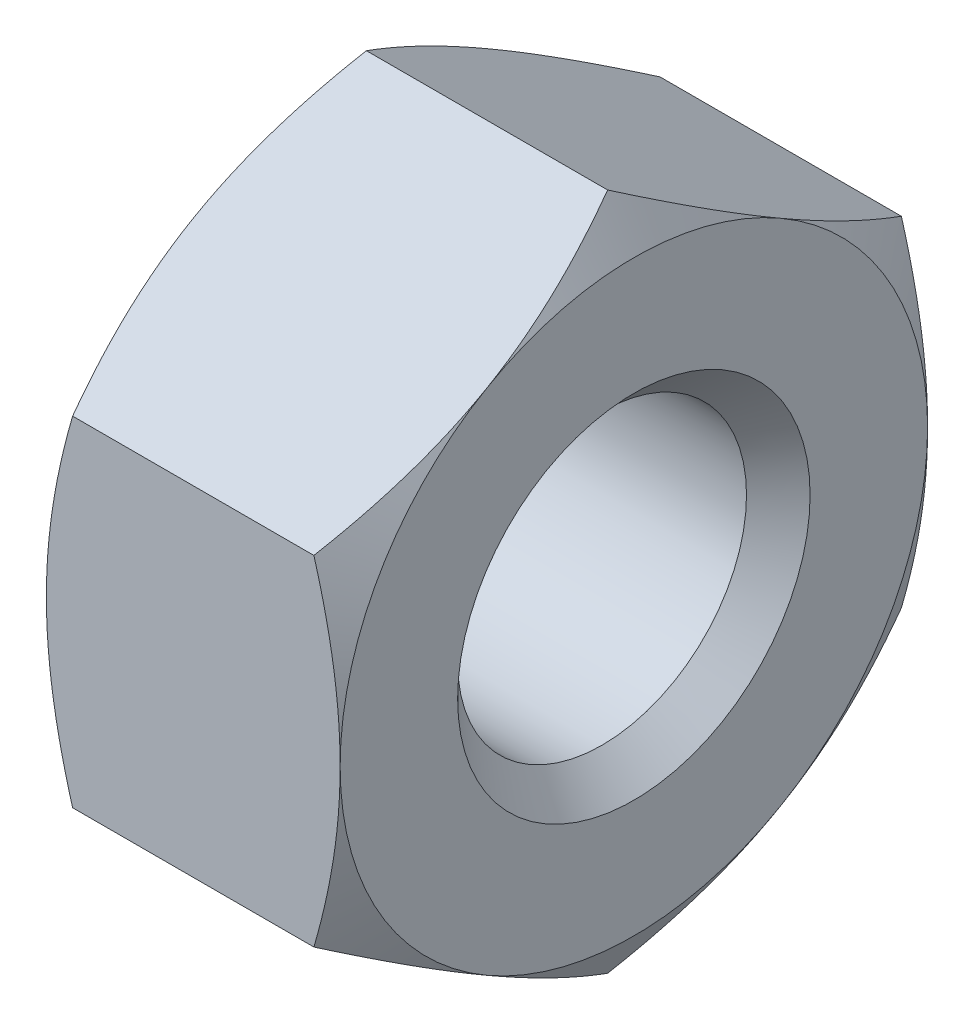
ISO-10303-21;
HEADER;
FILE_DESCRIPTION(('STEP AP214'),'2;1');
FILE_NAME('part.step','',(''),(''),'','','');
FILE_SCHEMA(('AUTOMOTIVE_DESIGN { 1 0 10303 214 1 1 1 1 }'));
ENDSEC;
DATA;
#1=APPLICATION_CONTEXT('core data for automotive mechanical design processes');
#2=APPLICATION_PROTOCOL_DEFINITION('international standard','automotive_design',2000,#1);
#3=PRODUCT_CONTEXT('',#1,'mechanical');
#4=PRODUCT('Part','Part','',(#3));
#5=PRODUCT_RELATED_PRODUCT_CATEGORY('part','',(#4));
#6=PRODUCT_DEFINITION_FORMATION('','',#4);
#7=PRODUCT_DEFINITION_CONTEXT('part definition',#1,'design');
#8=PRODUCT_DEFINITION('design','',#6,#7);
#9=PRODUCT_DEFINITION_SHAPE('','',#8);
#10=(LENGTH_UNIT() NAMED_UNIT(*) SI_UNIT(.MILLI.,.METRE.));
#11=(NAMED_UNIT(*) PLANE_ANGLE_UNIT() SI_UNIT($,.RADIAN.));
#12=(NAMED_UNIT(*) SI_UNIT($,.STERADIAN.) SOLID_ANGLE_UNIT());
#13=UNCERTAINTY_MEASURE_WITH_UNIT(LENGTH_MEASURE(1.E-05),#10,'distance_accuracy_value','');
#14=(GEOMETRIC_REPRESENTATION_CONTEXT(3) GLOBAL_UNCERTAINTY_ASSIGNED_CONTEXT((#13)) GLOBAL_UNIT_ASSIGNED_CONTEXT((#10,
#11,#12)) REPRESENTATION_CONTEXT('',''));
#15=CARTESIAN_POINT('',(0.,0.,0.));
#16=DIRECTION('',(0.,0.,1.));
#17=DIRECTION('',(1.,0.,0.));
#18=AXIS2_PLACEMENT_3D('',#15,#16,#17);
#19=CARTESIAN_POINT('',(0.,0.,0.));
#20=DIRECTION('',(1.,0.,0.));
#21=DIRECTION('',(0.,0.,1.));
#22=AXIS2_PLACEMENT_3D('',#19,#20,#21);
#23=CONICAL_SURFACE('',#22,5.,1.0471975511966);
#24=CARTESIAN_POINT('',(0.44658265405207,5.7735038465968,1.99999999777956E-06));
#25=CARTESIAN_POINT('',(0.37332598716151,5.64664194849674,-0.219729253053926));
#26=CARTESIAN_POINT('',(0.306696499123913,5.51869499330503,-0.441339880119704));
#27=CARTESIAN_POINT('',(0.190396118236588,5.26058573190113,-0.888398234775336));
#28=CARTESIAN_POINT('',(0.140766361965004,5.1304188409881,-1.11385390329997));
#29=CARTESIAN_POINT('',(0.0635265661027221,4.87167833614423,-1.56200560366558));
#30=CARTESIAN_POINT('',(0.0354020000705384,4.74314500903636,-1.78463185668229));
#31=CARTESIAN_POINT('',(0.010185357115864,4.54989306416545,-2.1193540438602));
#32=CARTESIAN_POINT('',(0.00460678031103294,4.48543168714627,-2.23100442398328));
#33=CARTESIAN_POINT('',(-0.000798864516523034,4.35644942308917,-2.45440825860544));
#34=CARTESIAN_POINT('',(-0.000626110285725697,4.29192853795199,-2.56616170981234));
#35=CARTESIAN_POINT('',(0.00776164598232361,4.11517425168036,-2.87230911409038));
#36=CARTESIAN_POINT('',(0.0218388857035264,4.00299946429515,-3.0666015451698));
#37=CARTESIAN_POINT('',(0.0664713963261781,3.77939435471464,-3.45389695579526));
#38=CARTESIAN_POINT('',(0.0970419133402497,3.66796481805389,-3.64689857475554));
#39=CARTESIAN_POINT('',(0.173457793217001,3.44390947117283,-4.034973819261));
#40=CARTESIAN_POINT('',(0.219626846873475,3.33131192785643,-4.22999848509243));
#41=CARTESIAN_POINT('',(0.324411243516021,3.10779574582578,-4.61713986868334));
#42=CARTESIAN_POINT('',(0.383001981758949,2.99687424581388,-4.8092615423557));
#43=CARTESIAN_POINT('',(0.446582654052072,2.88675019124759,-5.000002));
#44=B_SPLINE_CURVE_WITH_KNOTS('',3,(#24,#25,#26,#27,#28,#29,#30,#31,#32,#33,#34,#35,#36,#37,#38,
#39,#40,#41,#42,#43),.UNSPECIFIED.,.F.,.F.,(4,2,2,2,2,2,2,2,2,4),(0.,0.792540187012441,
1.5869848631385,2.36176947896395,2.7487878698634,3.13579429986344,3.80946255620209,
4.48375460996337,5.17299926182492,5.86089121185927),.UNSPECIFIED.);
#45=CARTESIAN_POINT('',(0.,4.3301270189222,-2.5));
#46=VERTEX_POINT('',#45);
#47=CARTESIAN_POINT('',(0.446581987385204,2.88675134594813,-5.));
#48=VERTEX_POINT('',#47);
#49=EDGE_CURVE('E222',#46,#48,#44,.T.);
#50=ORIENTED_EDGE('',*,*,#49,.T.);
#51=CARTESIAN_POINT('',(2.39269148779686,7.65620989160719,-5.));
#52=CARTESIAN_POINT('',(2.28660235028858,7.43668068445187,-5.));
#53=CARTESIAN_POINT('',(2.18156779028806,7.21663244981121,-5.));
#54=CARTESIAN_POINT('',(1.97421044339545,6.775217292149,-5.));
#55=CARTESIAN_POINT('',(1.87188812598847,6.55385014884432,-5.));
#56=CARTESIAN_POINT('',(1.67001886896127,6.10832079221155,-5.));
#57=CARTESIAN_POINT('',(1.57049116143975,5.8841498332562,-5.));
#58=CARTESIAN_POINT('',(1.37571053321072,5.43396545890422,-5.));
#59=CARTESIAN_POINT('',(1.28045738968839,5.20795214026934,-5.));
#60=CARTESIAN_POINT('',(1.09423146437322,4.75091730358843,-5.));
#61=CARTESIAN_POINT('',(1.00332560531799,4.51986836696229,-5.));
#62=CARTESIAN_POINT('',(0.82863336464981,4.05504511794165,-5.));
#63=CARTESIAN_POINT('',(0.744847775114849,3.82127050561654,-5.));
#64=CARTESIAN_POINT('',(0.586647048773664,3.3511049214154,-5.));
#65=CARTESIAN_POINT('',(0.512211991475932,3.1147207202618,-5.));
#66=CARTESIAN_POINT('',(0.375130527892477,2.63858935414023,-5.));
#67=CARTESIAN_POINT('',(0.312480393737602,2.39884327849117,-5.));
#68=CARTESIAN_POINT('',(0.20200698482826,1.91583600979795,-5.));
#69=CARTESIAN_POINT('',(0.154187651535998,1.67257390027251,-5.));
#70=CARTESIAN_POINT('',(0.076607391051974,1.18308256945893,-5.));
#71=CARTESIAN_POINT('',(0.0468464796939312,0.936853345569398,-5.));
#72=CARTESIAN_POINT('',(0.0176567486688216,0.567117593289448,-5.));
#73=CARTESIAN_POINT('',(0.0105006336509126,0.444189898759252,-5.));
#74=CARTESIAN_POINT('',(0.00139734410694163,0.198136128994918,-5.));
#75=CARTESIAN_POINT('',(-0.000549898076788793,0.0750100563582855,-5.));
#76=CARTESIAN_POINT('',(0.000816862251923973,-0.171177216207569,-5.));
#77=CARTESIAN_POINT('',(0.00412938670343826,-0.294238424644023,-5.));
#78=CARTESIAN_POINT('',(0.0159317259689098,-0.540114422491313,-5.));
#79=CARTESIAN_POINT('',(0.0244218020511685,-0.662929199152971,-5.));
#80=CARTESIAN_POINT('',(0.0510977870839178,-0.960602635172518,-5.));
#81=CARTESIAN_POINT('',(0.0718785337524636,-1.13523252606317,-5.));
#82=CARTESIAN_POINT('',(0.122751407752216,-1.48312982453558,-5.));
#83=CARTESIAN_POINT('',(0.152844776631892,-1.65639704728773,-5.));
#84=CARTESIAN_POINT('',(0.221278562314374,-2.0014599099285,-5.));
#85=CARTESIAN_POINT('',(0.259627212482436,-2.17325390132186,-5.));
#86=CARTESIAN_POINT('',(0.343401963406937,-2.51508012917844,-5.));
#87=CARTESIAN_POINT('',(0.388827633284757,-2.68511247222647,-5.));
#88=CARTESIAN_POINT('',(0.48685534457665,-3.02759472997325,-5.));
#89=CARTESIAN_POINT('',(0.539605921564314,-3.20000183568427,-5.));
#90=CARTESIAN_POINT('',(0.650319392974467,-3.54299370259062,-5.));
#91=CARTESIAN_POINT('',(0.708278692348679,-3.71357963115188,-5.));
#92=CARTESIAN_POINT('',(0.828212380999504,-4.0522446464634,-5.));
#93=CARTESIAN_POINT('',(0.890162334838547,-4.22033243885281,-5.));
#94=CARTESIAN_POINT('',(1.01769851692208,-4.55520387372807,-5.));
#95=CARTESIAN_POINT('',(1.08328621472348,-4.72198695763952,-5.));
#96=CARTESIAN_POINT('',(1.15033293692307,-4.88816412582648,-5.));
#97=B_SPLINE_CURVE_WITH_KNOTS('',3,(#51,#52,#53,#54,#55,#56,#57,#58,#59,#60,#61,#62,#63,#64,#65,
#66,#67,#68,#69,#70,#71,#72,#73,#74,#75,#76,#77,#78,#79,#80,#81,#82,#83,#84,#85,#86,#87,#88,#89,
#90,#91,#92,#93,#94,#95,#96),.UNSPECIFIED.,.F.,.F.,(4,2,2,2,2,2,2,2,2,2,2,2,2,2,2,2,2,2,2,2,2,2,
4),(0.,0.731468501053905,1.46306280212576,2.19884351250473,2.93458582511369,3.67936259473396,
4.42422210717282,5.16746683356836,5.91047605604179,6.65368257320434,7.39688974201328,
7.76620341787991,8.13551229673491,8.50471741349089,8.87394116252394,9.40123334160666,
9.92859584900566,10.456486776027,10.9843455753877,11.5251349139371,12.0655538262241,
12.6029309498223,13.1405267642076),.UNSPECIFIED.);
#98=CARTESIAN_POINT('',(0.,0.,-5.));
#99=VERTEX_POINT('',#98);
#100=EDGE_CURVE('E118',#48,#99,#97,.T.);
#101=ORIENTED_EDGE('',*,*,#100,.T.);
#102=CARTESIAN_POINT('',(0.,0.,0.));
#103=DIRECTION('',(-1.,0.,0.));
#104=DIRECTION('',(0.,0.,-1.));
#105=AXIS2_PLACEMENT_3D('',#102,#103,#104);
#106=CIRCLE('',#105,5.);
#107=EDGE_CURVE('E256',#46,#99,#106,.T.);
#108=ORIENTED_EDGE('',*,*,#107,.F.);
#109=EDGE_LOOP('',(#50,#101,#108));
#110=FACE_BOUND('',#109,.T.);
#111=ADVANCED_FACE('F15',(#110),#23,.T.);
#112=CARTESIAN_POINT('',(0.,-4.3301270189222,-2.5));
#113=VERTEX_POINT('',#112);
#114=EDGE_CURVE('E248',#99,#113,#106,.T.);
#115=ORIENTED_EDGE('',*,*,#114,.F.);
#116=CARTESIAN_POINT('',(0.446581987385204,-2.88675134594813,-5.));
#117=VERTEX_POINT('',#116);
#118=EDGE_CURVE('E216',#99,#117,#97,.T.);
#119=ORIENTED_EDGE('',*,*,#118,.T.);
#120=CARTESIAN_POINT('',(0.446582654052072,-2.88675019124759,-5.000002));
#121=CARTESIAN_POINT('',(0.373325987161512,-3.01361208934765,-4.78027074694607));
#122=CARTESIAN_POINT('',(0.306696499123915,-3.14155904453936,-4.5586601198803));
#123=CARTESIAN_POINT('',(0.19039611823659,-3.39966830594326,-4.11160176522466));
#124=CARTESIAN_POINT('',(0.140766361965006,-3.52983519685628,-3.88614609670003));
#125=CARTESIAN_POINT('',(0.0635265661027237,-3.78857570170016,-3.43799439633442));
#126=CARTESIAN_POINT('',(0.0354020000705395,-3.91710902880803,-3.21536814331771));
#127=CARTESIAN_POINT('',(0.0101853571158656,-4.11036097367894,-2.8806459561398));
#128=CARTESIAN_POINT('',(0.00460678031103495,-4.17482235069812,-2.76899557601673));
#129=CARTESIAN_POINT('',(-0.000798864516521227,-4.30380461475522,-2.54559174139456));
#130=CARTESIAN_POINT('',(-0.000626110285724489,-4.3683254998924,-2.43383829018766));
#131=CARTESIAN_POINT('',(0.00776164598232428,-4.54507978616402,-2.12769088590962));
#132=CARTESIAN_POINT('',(0.021838885703528,-4.65725457354923,-1.9333984548302));
#133=CARTESIAN_POINT('',(0.06647139632618,-4.88085968312975,-1.54610304420474));
#134=CARTESIAN_POINT('',(0.0970419133402511,-4.9922892197905,-1.35310142524446));
#135=CARTESIAN_POINT('',(0.173457793217002,-5.21634456667156,-0.965026180739005));
#136=CARTESIAN_POINT('',(0.219626846873477,-5.32894210998796,-0.770001514907569));
#137=CARTESIAN_POINT('',(0.324411243516023,-5.55245829201861,-0.382860131316659));
#138=CARTESIAN_POINT('',(0.383001981758951,-5.66337979203051,-0.1907384576443));
#139=CARTESIAN_POINT('',(0.446582654052072,-5.7735038465968,2.00000000049962E-06));
#140=B_SPLINE_CURVE_WITH_KNOTS('',3,(#120,#121,#122,#123,#124,#125,#126,#127,#128,#129,#130,
#131,#132,#133,#134,#135,#136,#137,#138,#139),.UNSPECIFIED.,.F.,.F.,(4,2,2,2,2,2,2,2,2,4),(0.,
0.79254018701244,1.58698486313849,2.36176947896395,2.74878786986339,3.13579429986343,
3.80946255620209,4.48375460996337,5.17299926182492,5.86089121185927),.UNSPECIFIED.);
#141=EDGE_CURVE('E210',#117,#113,#140,.T.);
#142=ORIENTED_EDGE('',*,*,#141,.T.);
#143=EDGE_LOOP('',(#115,#119,#142));
#144=FACE_BOUND('',#143,.T.);
#145=ADVANCED_FACE('F245',(#144),#23,.T.);
#146=CARTESIAN_POINT('',(0.,-4.33012701892219,2.5));
#147=VERTEX_POINT('',#146);
#148=EDGE_CURVE('E254',#113,#147,#106,.T.);
#149=ORIENTED_EDGE('',*,*,#148,.F.);
#150=CARTESIAN_POINT('',(0.446581987385205,-5.77350269189626,0.));
#151=VERTEX_POINT('',#150);
#152=EDGE_CURVE('E202',#113,#151,#140,.T.);
#153=ORIENTED_EDGE('',*,*,#152,.T.);
#154=CARTESIAN_POINT('',(0.446582654052072,-5.7735038465968,-1.99999999964649E-06));
#155=CARTESIAN_POINT('',(0.373325987161511,-5.64664194849674,0.219729253053924));
#156=CARTESIAN_POINT('',(0.306696499123914,-5.51869499330503,0.441339880119701));
#157=CARTESIAN_POINT('',(0.190396118236588,-5.26058573190113,0.888398234775332));
#158=CARTESIAN_POINT('',(0.140766361965004,-5.1304188409881,1.11385390329997));
#159=CARTESIAN_POINT('',(0.0635265661027221,-4.87167833614423,1.56200560366558));
#160=CARTESIAN_POINT('',(0.0354020000705381,-4.74314500903636,1.78463185668228));
#161=CARTESIAN_POINT('',(0.0101853571158635,-4.54989306416545,2.1193540438602));
#162=CARTESIAN_POINT('',(0.00460678031103241,-4.48543168714627,2.23100442398327));
#163=CARTESIAN_POINT('',(-0.000798864516523425,-4.35644942308917,2.45440825860543));
#164=CARTESIAN_POINT('',(-0.000626110285725903,-4.29192853795199,2.56616170981234));
#165=CARTESIAN_POINT('',(0.00776164598232342,-4.11517425168036,2.87230911409038));
#166=CARTESIAN_POINT('',(0.0218388857035257,-4.00299946429515,3.06660154516979));
#167=CARTESIAN_POINT('',(0.0664713963261767,-3.77939435471464,3.45389695579525));
#168=CARTESIAN_POINT('',(0.097041913340248,-3.66796481805388,3.64689857475554));
#169=CARTESIAN_POINT('',(0.173457793216999,-3.44390947117283,4.03497381926099));
#170=CARTESIAN_POINT('',(0.219626846873474,-3.33131192785643,4.22999848509243));
#171=CARTESIAN_POINT('',(0.32441124351602,-3.10779574582577,4.61713986868334));
#172=CARTESIAN_POINT('',(0.383001981758949,-2.99687424581388,4.8092615423557));
#173=CARTESIAN_POINT('',(0.446582654052072,-2.88675019124759,5.000002));
#174=B_SPLINE_CURVE_WITH_KNOTS('',3,(#154,#155,#156,#157,#158,#159,#160,#161,#162,#163,#164,
#165,#166,#167,#168,#169,#170,#171,#172,#173),.UNSPECIFIED.,.F.,.F.,(4,2,2,2,2,2,2,2,2,4),(0.,
0.79254018701244,1.5869848631385,2.36176947896395,2.7487878698634,3.13579429986344,
3.80946255620209,4.48375460996337,5.17299926182492,5.86089121185928),.UNSPECIFIED.);
#175=EDGE_CURVE('E505',#151,#147,#174,.T.);
#176=ORIENTED_EDGE('',*,*,#175,.T.);
#177=EDGE_LOOP('',(#149,#153,#176));
#178=FACE_BOUND('',#177,.T.);
#179=ADVANCED_FACE('F336',(#178),#23,.T.);
#180=CARTESIAN_POINT('',(0.446582654052071,2.88675019124759,5.000002));
#181=CARTESIAN_POINT('',(0.373325987161511,3.01361208934765,4.78027074694607));
#182=CARTESIAN_POINT('',(0.306696499123914,3.14155904453936,4.55866011988029));
#183=CARTESIAN_POINT('',(0.190396118236589,3.39966830594326,4.11160176522466));
#184=CARTESIAN_POINT('',(0.140766361965004,3.52983519685628,3.88614609670003));
#185=CARTESIAN_POINT('',(0.063526566102723,3.78857570170016,3.43799439633442));
#186=CARTESIAN_POINT('',(0.0354020000705395,3.91710902880803,3.21536814331771));
#187=CARTESIAN_POINT('',(0.0101853571158649,4.11036097367894,2.8806459561398));
#188=CARTESIAN_POINT('',(0.00460678031103366,4.17482235069812,2.76899557601673));
#189=CARTESIAN_POINT('',(-0.000798864516522484,4.30380461475522,2.54559174139456));
#190=CARTESIAN_POINT('',(-0.000626110285725161,4.3683254998924,2.43383829018766));
#191=CARTESIAN_POINT('',(0.0077616459823242,4.54507978616402,2.12769088590962));
#192=CARTESIAN_POINT('',(0.0218388857035272,4.65725457354923,1.9333984548302));
#193=CARTESIAN_POINT('',(0.0664713963261789,4.88085968312975,1.54610304420474));
#194=CARTESIAN_POINT('',(0.0970419133402503,4.9922892197905,1.35310142524446));
#195=CARTESIAN_POINT('',(0.173457793217002,5.21634456667156,0.965026180739003));
#196=CARTESIAN_POINT('',(0.219626846873476,5.32894210998796,0.770001514907566));
#197=CARTESIAN_POINT('',(0.324411243516022,5.55245829201861,0.382860131316657));
#198=CARTESIAN_POINT('',(0.383001981758949,5.66337979203051,0.190738457644298));
#199=CARTESIAN_POINT('',(0.446582654052071,5.7735038465968,-2.00000000201083E-06));
#200=B_SPLINE_CURVE_WITH_KNOTS('',3,(#180,#181,#182,#183,#184,#185,#186,#187,#188,#189,#190,
#191,#192,#193,#194,#195,#196,#197,#198,#199),.UNSPECIFIED.,.F.,.F.,(4,2,2,2,2,2,2,2,2,4),(0.,
0.79254018701244,1.5869848631385,2.36176947896395,2.7487878698634,3.13579429986343,
3.80946255620209,4.48375460996337,5.17299926182492,5.86089121185927),.UNSPECIFIED.);
#201=CARTESIAN_POINT('',(0.,4.3301270189222,2.5));
#202=VERTEX_POINT('',#201);
#203=CARTESIAN_POINT('',(0.446581987385204,5.77350269189626,0.));
#204=VERTEX_POINT('',#203);
#205=EDGE_CURVE('E362',#202,#204,#200,.T.);
#206=ORIENTED_EDGE('',*,*,#205,.T.);
#207=EDGE_CURVE('E211',#204,#46,#44,.T.);
#208=ORIENTED_EDGE('',*,*,#207,.T.);
#209=EDGE_CURVE('E265',#202,#46,#106,.T.);
#210=ORIENTED_EDGE('',*,*,#209,.F.);
#211=EDGE_LOOP('',(#206,#208,#210));
#212=FACE_BOUND('',#211,.T.);
#213=ADVANCED_FACE('F344',(#212),#23,.T.);
#214=CARTESIAN_POINT('',(0.,0.,5.));
#215=VERTEX_POINT('',#214);
#216=EDGE_CURVE('E262',#147,#215,#106,.T.);
#217=ORIENTED_EDGE('',*,*,#216,.F.);
#218=CARTESIAN_POINT('',(0.446581987385204,-2.88675134594812,5.));
#219=VERTEX_POINT('',#218);
#220=EDGE_CURVE('E37',#147,#219,#174,.T.);
#221=ORIENTED_EDGE('',*,*,#220,.T.);
#222=CARTESIAN_POINT('',(2.39269148779686,7.6562098916072,5.));
#223=CARTESIAN_POINT('',(2.28660235028858,7.43668068445188,5.));
#224=CARTESIAN_POINT('',(2.18156779028806,7.21663244981121,5.));
#225=CARTESIAN_POINT('',(1.97421044339545,6.77521729214901,5.));
#226=CARTESIAN_POINT('',(1.87188812598847,6.55385014884433,5.));
#227=CARTESIAN_POINT('',(1.67001886896127,6.10832079221155,5.));
#228=CARTESIAN_POINT('',(1.57049116143975,5.8841498332562,5.));
#229=CARTESIAN_POINT('',(1.37571053321072,5.43396545890423,5.));
#230=CARTESIAN_POINT('',(1.28045738968839,5.20795214026935,5.));
#231=CARTESIAN_POINT('',(1.09423146437322,4.75091730358843,5.));
#232=CARTESIAN_POINT('',(1.00332560531799,4.51986836696229,5.));
#233=CARTESIAN_POINT('',(0.82863336464981,4.05504511794166,5.));
#234=CARTESIAN_POINT('',(0.744847775114849,3.82127050561655,5.));
#235=CARTESIAN_POINT('',(0.586647048773665,3.3511049214154,5.));
#236=CARTESIAN_POINT('',(0.512211991475933,3.1147207202618,5.));
#237=CARTESIAN_POINT('',(0.375130527892477,2.63858935414024,5.));
#238=CARTESIAN_POINT('',(0.312480393737602,2.39884327849118,5.));
#239=CARTESIAN_POINT('',(0.202006984828261,1.91583600979795,5.));
#240=CARTESIAN_POINT('',(0.154187651535998,1.67257390027251,5.));
#241=CARTESIAN_POINT('',(0.0766073910519745,1.18308256945893,5.));
#242=CARTESIAN_POINT('',(0.0468464796939318,0.936853345569402,5.));
#243=CARTESIAN_POINT('',(0.0176567486688219,0.567117593289453,5.));
#244=CARTESIAN_POINT('',(0.0105006336509127,0.444189898759257,5.));
#245=CARTESIAN_POINT('',(0.00139734410694169,0.198136128994924,5.));
#246=CARTESIAN_POINT('',(-0.000549898076788581,0.0750100563582913,5.));
#247=CARTESIAN_POINT('',(0.000816862251924464,-0.171177216207563,5.));
#248=CARTESIAN_POINT('',(0.00412938670343887,-0.294238424644018,5.));
#249=CARTESIAN_POINT('',(0.0159317259689104,-0.540114422491308,5.));
#250=CARTESIAN_POINT('',(0.024421802051169,-0.662929199152966,5.));
#251=CARTESIAN_POINT('',(0.0510977870839183,-0.960602635172514,5.));
#252=CARTESIAN_POINT('',(0.0718785337524642,-1.13523252606317,5.));
#253=CARTESIAN_POINT('',(0.122751407752217,-1.48312982453558,5.));
#254=CARTESIAN_POINT('',(0.152844776631893,-1.65639704728773,5.));
#255=CARTESIAN_POINT('',(0.221278562314375,-2.00145990992849,5.));
#256=CARTESIAN_POINT('',(0.259627212482438,-2.17325390132185,5.));
#257=CARTESIAN_POINT('',(0.343401963406939,-2.51508012917843,5.));
#258=CARTESIAN_POINT('',(0.388827633284758,-2.68511247222647,5.));
#259=CARTESIAN_POINT('',(0.486855344576652,-3.02759472997325,5.));
#260=CARTESIAN_POINT('',(0.539605921564316,-3.20000183568427,5.));
#261=CARTESIAN_POINT('',(0.650319392974469,-3.54299370259062,5.));
#262=CARTESIAN_POINT('',(0.708278692348681,-3.71357963115188,5.));
#263=CARTESIAN_POINT('',(0.828212380999506,-4.0522446464634,5.));
#264=CARTESIAN_POINT('',(0.890162334838549,-4.22033243885281,5.00000000000001));
#265=CARTESIAN_POINT('',(1.01769851692208,-4.55520387372807,5.00000000000001));
#266=CARTESIAN_POINT('',(1.08328621472348,-4.72198695763951,5.));
#267=CARTESIAN_POINT('',(1.15033293692307,-4.88816412582648,5.));
#268=B_SPLINE_CURVE_WITH_KNOTS('',3,(#222,#223,#224,#225,#226,#227,#228,#229,#230,#231,#232,
#233,#234,#235,#236,#237,#238,#239,#240,#241,#242,#243,#244,#245,#246,#247,#248,#249,#250,#251,
#252,#253,#254,#255,#256,#257,#258,#259,#260,#261,#262,#263,#264,#265,#266,#267),.UNSPECIFIED.,
.F.,.F.,(4,2,2,2,2,2,2,2,2,2,2,2,2,2,2,2,2,2,2,2,2,2,4),(0.,0.731468501053905,1.46306280212576,
2.19884351250474,2.93458582511369,3.67936259473396,4.42422210717282,5.16746683356836,
5.91047605604179,6.65368257320434,7.39688974201329,7.76620341787991,8.13551229673491,
8.5047174134909,8.87394116252395,9.40123334160666,9.92859584900567,10.456486776027,
10.9843455753877,11.5251349139371,12.0655538262241,12.6029309498223,13.1405267642076),.UNSPECIFIED.);
#269=EDGE_CURVE('E9',#219,#215,#268,.F.);
#270=ORIENTED_EDGE('',*,*,#269,.T.);
#271=EDGE_LOOP('',(#217,#221,#270));
#272=FACE_BOUND('',#271,.T.);
#273=ADVANCED_FACE('F339',(#272),#23,.T.);
#274=CARTESIAN_POINT('',(0.446581987385204,2.88675134594813,5.));
#275=VERTEX_POINT('',#274);
#276=EDGE_CURVE('E20',#215,#275,#268,.F.);
#277=ORIENTED_EDGE('',*,*,#276,.T.);
#278=EDGE_CURVE('E125',#275,#202,#200,.T.);
#279=ORIENTED_EDGE('',*,*,#278,.T.);
#280=EDGE_CURVE('E272',#215,#202,#106,.T.);
#281=ORIENTED_EDGE('',*,*,#280,.F.);
#282=EDGE_LOOP('',(#277,#279,#281));
#283=FACE_BOUND('',#282,.T.);
#284=ADVANCED_FACE('F152',(#283),#23,.T.);
#285=CARTESIAN_POINT('',(4.55255354137804,0.,0.));
#286=DIRECTION('',(-1.,0.,0.));
#287=DIRECTION('',(0.,0.,-1.));
#288=AXIS2_PLACEMENT_3D('',#285,#286,#287);
#289=CONICAL_SURFACE('',#288,5.775,1.0471975511966);
#290=CARTESIAN_POINT('',(2.60730851220314,7.6562098916072,5.));
#291=CARTESIAN_POINT('',(2.71339764971142,7.43668068445188,5.));
#292=CARTESIAN_POINT('',(2.81843220971194,7.21663244981121,5.));
#293=CARTESIAN_POINT('',(3.02578955660455,6.77521729214901,5.));
#294=CARTESIAN_POINT('',(3.12811187401152,6.55385014884433,5.));
#295=CARTESIAN_POINT('',(3.32998113103873,6.10832079221155,5.));
#296=CARTESIAN_POINT('',(3.42950883856025,5.8841498332562,5.));
#297=CARTESIAN_POINT('',(3.62428946678928,5.43396545890423,5.));
#298=CARTESIAN_POINT('',(3.71954261031161,5.20795214026935,5.));
#299=CARTESIAN_POINT('',(3.90576853562678,4.75091730358843,5.));
#300=CARTESIAN_POINT('',(3.99667439468201,4.51986836696229,5.));
#301=CARTESIAN_POINT('',(4.17136663535019,4.05504511794166,5.));
#302=CARTESIAN_POINT('',(4.25515222488515,3.82127050561655,5.));
#303=CARTESIAN_POINT('',(4.41335295122633,3.35110492141541,5.));
#304=CARTESIAN_POINT('',(4.48778800852407,3.1147207202618,5.));
#305=CARTESIAN_POINT('',(4.62486947210752,2.63858935414024,5.));
#306=CARTESIAN_POINT('',(4.6875196062624,2.39884327849118,5.));
#307=CARTESIAN_POINT('',(4.79799301517174,1.91583600979796,5.));
#308=CARTESIAN_POINT('',(4.845812348464,1.67257390027252,5.));
#309=CARTESIAN_POINT('',(4.92339260894802,1.18308256945893,5.));
#310=CARTESIAN_POINT('',(4.95315352030607,0.936853345569404,5.));
#311=CARTESIAN_POINT('',(4.98234325133118,0.567117593289454,5.));
#312=CARTESIAN_POINT('',(4.98949936634909,0.444189898759258,5.));
#313=CARTESIAN_POINT('',(4.99860265589306,0.198136128994925,5.));
#314=CARTESIAN_POINT('',(5.00054989807679,0.0750100563582916,5.));
#315=CARTESIAN_POINT('',(4.99918313774807,-0.171177216207563,5.));
#316=CARTESIAN_POINT('',(4.99587061329656,-0.294238424644017,5.));
#317=CARTESIAN_POINT('',(4.98406827403109,-0.540114422491307,5.));
#318=CARTESIAN_POINT('',(4.97557819794883,-0.662929199152966,5.));
#319=CARTESIAN_POINT('',(4.94890221291608,-0.960602635172514,5.));
#320=CARTESIAN_POINT('',(4.92812146624754,-1.13523252606317,5.));
#321=CARTESIAN_POINT('',(4.87724859224778,-1.48312982453558,5.));
#322=CARTESIAN_POINT('',(4.84715522336811,-1.65639704728773,5.));
#323=CARTESIAN_POINT('',(4.77872143768563,-2.0014599099285,5.));
#324=CARTESIAN_POINT('',(4.74037278751756,-2.17325390132186,5.));
#325=CARTESIAN_POINT('',(4.65659803659306,-2.51508012917844,5.));
#326=CARTESIAN_POINT('',(4.61117236671524,-2.68511247222647,5.));
#327=CARTESIAN_POINT('',(4.51314465542335,-3.02759472997325,5.));
#328=CARTESIAN_POINT('',(4.46039407843569,-3.20000183568427,5.));
#329=CARTESIAN_POINT('',(4.34968060702553,-3.54299370259062,5.));
#330=CARTESIAN_POINT('',(4.29172130765132,-3.71357963115188,5.));
#331=CARTESIAN_POINT('',(4.17178761900049,-4.05224464646339,5.));
#332=CARTESIAN_POINT('',(4.10983766516145,-4.22033243885281,5.00000000000001));
#333=CARTESIAN_POINT('',(3.98230148307792,-4.55520387372807,5.00000000000001));
#334=CARTESIAN_POINT('',(3.91671378527652,-4.72198695763951,5.));
#335=CARTESIAN_POINT('',(3.84966706307693,-4.88816412582648,5.));
#336=B_SPLINE_CURVE_WITH_KNOTS('',3,(#290,#291,#292,#293,#294,#295,#296,#297,#298,#299,#300,
#301,#302,#303,#304,#305,#306,#307,#308,#309,#310,#311,#312,#313,#314,#315,#316,#317,#318,#319,
#320,#321,#322,#323,#324,#325,#326,#327,#328,#329,#330,#331,#332,#333,#334,#335),.UNSPECIFIED.,
.F.,.F.,(4,2,2,2,2,2,2,2,2,2,2,2,2,2,2,2,2,2,2,2,2,2,4),(0.,0.731468501053904,1.46306280212576,
2.19884351250474,2.93458582511369,3.67936259473396,4.42422210717282,5.16746683356836,
5.91047605604179,6.65368257320434,7.39688974201329,7.76620341787991,8.13551229673491,
8.5047174134909,8.87394116252395,9.40123334160666,9.92859584900567,10.456486776027,
10.9843455753877,11.5251349139371,12.0655538262241,12.6029309498223,13.1405267642076),.UNSPECIFIED.);
#337=CARTESIAN_POINT('',(5.,0.,5.));
#338=VERTEX_POINT('',#337);
#339=CARTESIAN_POINT('',(4.5534180126148,-2.88675134594812,5.));
#340=VERTEX_POINT('',#339);
#341=EDGE_CURVE('E114',#338,#340,#336,.T.);
#342=ORIENTED_EDGE('',*,*,#341,.T.);
#343=CARTESIAN_POINT('',(4.55341734594793,-2.88675019124759,5.000002));
#344=CARTESIAN_POINT('',(4.62667401283849,-3.01361208934764,4.78027074694607));
#345=CARTESIAN_POINT('',(4.69330350087609,-3.14155904453935,4.5586601198803));
#346=CARTESIAN_POINT('',(4.80960388176341,-3.39966830594325,4.11160176522467));
#347=CARTESIAN_POINT('',(4.859233638035,-3.52983519685628,3.88614609670003));
#348=CARTESIAN_POINT('',(4.93647343389728,-3.78857570170015,3.43799439633442));
#349=CARTESIAN_POINT('',(4.96459799992946,-3.91710902880802,3.21536814331772));
#350=CARTESIAN_POINT('',(4.98981464288414,-4.11036097367893,2.8806459561398));
#351=CARTESIAN_POINT('',(4.99539321968897,-4.17482235069811,2.76899557601673));
#352=CARTESIAN_POINT('',(5.00079886451652,-4.30380461475521,2.54559174139457));
#353=CARTESIAN_POINT('',(5.00062611028573,-4.36832549989239,2.43383829018766));
#354=CARTESIAN_POINT('',(4.99223835401767,-4.54507978616402,2.12769088590962));
#355=CARTESIAN_POINT('',(4.97816111429647,-4.65725457354923,1.93339845483021));
#356=CARTESIAN_POINT('',(4.93352860367382,-4.88085968312974,1.54610304420475));
#357=CARTESIAN_POINT('',(4.90295808665975,-4.9922892197905,1.35310142524446));
#358=CARTESIAN_POINT('',(4.826542206783,-5.21634456667155,0.965026180739005));
#359=CARTESIAN_POINT('',(4.78037315312653,-5.32894210998795,0.770001514907568));
#360=CARTESIAN_POINT('',(4.67558875648398,-5.55245829201861,0.382860131316658));
#361=CARTESIAN_POINT('',(4.61699801824105,-5.66337979203051,0.190738457644299));
#362=CARTESIAN_POINT('',(4.55341734594793,-5.7735038465968,-1.99999999980049E-06));
#363=B_SPLINE_CURVE_WITH_KNOTS('',3,(#343,#344,#345,#346,#347,#348,#349,#350,#351,#352,#353,
#354,#355,#356,#357,#358,#359,#360,#361,#362),.UNSPECIFIED.,.F.,.F.,(4,2,2,2,2,2,2,2,2,4),(0.,
0.792540187012441,1.58698486313849,2.36176947896395,2.74878786986339,3.13579429986343,
3.80946255620209,4.48375460996337,5.17299926182492,5.86089121185928),.UNSPECIFIED.);
#364=CARTESIAN_POINT('',(5.,-4.33012701892219,2.5));
#365=VERTEX_POINT('',#364);
#366=EDGE_CURVE('E120',#340,#365,#363,.T.);
#367=ORIENTED_EDGE('',*,*,#366,.T.);
#368=CARTESIAN_POINT('',(5.,0.,0.));
#369=DIRECTION('',(-1.,0.,0.));
#370=DIRECTION('',(0.,0.,-1.));
#371=AXIS2_PLACEMENT_3D('',#368,#369,#370);
#372=CIRCLE('',#371,5.);
#373=EDGE_CURVE('E128',#365,#338,#372,.T.);
#374=ORIENTED_EDGE('',*,*,#373,.T.);
#375=EDGE_LOOP('',(#342,#367,#374));
#376=FACE_BOUND('',#375,.T.);
#377=ADVANCED_FACE('F127',(#376),#289,.T.);
#378=CARTESIAN_POINT('',(5.,-4.3301270189222,-2.5));
#379=VERTEX_POINT('',#378);
#380=EDGE_CURVE('E275',#379,#365,#372,.T.);
#381=ORIENTED_EDGE('',*,*,#380,.T.);
#382=CARTESIAN_POINT('',(4.5534180126148,-5.77350269189626,0.));
#383=VERTEX_POINT('',#382);
#384=EDGE_CURVE('E44',#365,#383,#363,.T.);
#385=ORIENTED_EDGE('',*,*,#384,.T.);
#386=CARTESIAN_POINT('',(4.55341734594793,-5.7735038465968,2.00000000044876E-06));
#387=CARTESIAN_POINT('',(4.62667401283849,-5.64664194849674,-0.219729253053924));
#388=CARTESIAN_POINT('',(4.69330350087609,-5.51869499330503,-0.441339880119702));
#389=CARTESIAN_POINT('',(4.80960388176341,-5.26058573190113,-0.888398234775334));
#390=CARTESIAN_POINT('',(4.859233638035,-5.13041884098811,-1.11385390329997));
#391=CARTESIAN_POINT('',(4.93647343389728,-4.87167833614423,-1.56200560366558));
#392=CARTESIAN_POINT('',(4.96459799992946,-4.74314500903636,-1.78463185668228));
#393=CARTESIAN_POINT('',(4.98981464288414,-4.54989306416545,-2.1193540438602));
#394=CARTESIAN_POINT('',(4.99539321968897,-4.48543168714627,-2.23100442398327));
#395=CARTESIAN_POINT('',(5.00079886451652,-4.35644942308917,-2.45440825860543));
#396=CARTESIAN_POINT('',(5.00062611028572,-4.29192853795199,-2.56616170981234));
#397=CARTESIAN_POINT('',(4.99223835401768,-4.11517425168036,-2.87230911409038));
#398=CARTESIAN_POINT('',(4.97816111429647,-4.00299946429515,-3.06660154516979));
#399=CARTESIAN_POINT('',(4.93352860367382,-3.77939435471464,-3.45389695579526));
#400=CARTESIAN_POINT('',(4.90295808665975,-3.66796481805389,-3.64689857475554));
#401=CARTESIAN_POINT('',(4.826542206783,-3.44390947117283,-4.03497381926099));
#402=CARTESIAN_POINT('',(4.78037315312652,-3.33131192785644,-4.22999848509243));
#403=CARTESIAN_POINT('',(4.67558875648398,-3.10779574582578,-4.61713986868334));
#404=CARTESIAN_POINT('',(4.61699801824105,-2.99687424581388,-4.8092615423557));
#405=CARTESIAN_POINT('',(4.55341734594793,-2.88675019124759,-5.000002));
#406=B_SPLINE_CURVE_WITH_KNOTS('',3,(#386,#387,#388,#389,#390,#391,#392,#393,#394,#395,#396,
#397,#398,#399,#400,#401,#402,#403,#404,#405),.UNSPECIFIED.,.F.,.F.,(4,2,2,2,2,2,2,2,2,4),(0.,
0.79254018701244,1.5869848631385,2.36176947896395,2.7487878698634,3.13579429986344,
3.80946255620209,4.48375460996337,5.17299926182492,5.86089121185927),.UNSPECIFIED.);
#407=EDGE_CURVE('E188',#383,#379,#406,.T.);
#408=ORIENTED_EDGE('',*,*,#407,.T.);
#409=EDGE_LOOP('',(#381,#385,#408));
#410=FACE_BOUND('',#409,.T.);
#411=ADVANCED_FACE('F151',(#410),#289,.T.);
#412=CARTESIAN_POINT('',(5.,0.,-5.));
#413=VERTEX_POINT('',#412);
#414=EDGE_CURVE('E266',#413,#379,#372,.T.);
#415=ORIENTED_EDGE('',*,*,#414,.T.);
#416=CARTESIAN_POINT('',(4.5534180126148,-2.88675134594813,-5.));
#417=VERTEX_POINT('',#416);
#418=EDGE_CURVE('E182',#379,#417,#406,.T.);
#419=ORIENTED_EDGE('',*,*,#418,.T.);
#420=CARTESIAN_POINT('',(2.60730851220314,7.6562098916072,-5.));
#421=CARTESIAN_POINT('',(2.71339764971142,7.43668068445188,-5.));
#422=CARTESIAN_POINT('',(2.81843220971194,7.21663244981121,-5.));
#423=CARTESIAN_POINT('',(3.02578955660455,6.77521729214901,-5.));
#424=CARTESIAN_POINT('',(3.12811187401152,6.55385014884433,-5.));
#425=CARTESIAN_POINT('',(3.32998113103873,6.10832079221155,-5.));
#426=CARTESIAN_POINT('',(3.42950883856025,5.8841498332562,-5.));
#427=CARTESIAN_POINT('',(3.62428946678928,5.43396545890423,-5.));
#428=CARTESIAN_POINT('',(3.71954261031161,5.20795214026935,-5.));
#429=CARTESIAN_POINT('',(3.90576853562678,4.75091730358843,-5.));
#430=CARTESIAN_POINT('',(3.99667439468201,4.51986836696229,-5.));
#431=CARTESIAN_POINT('',(4.17136663535019,4.05504511794165,-5.));
#432=CARTESIAN_POINT('',(4.25515222488515,3.82127050561654,-5.));
#433=CARTESIAN_POINT('',(4.41335295122634,3.3511049214154,-5.));
#434=CARTESIAN_POINT('',(4.48778800852407,3.1147207202618,-5.));
#435=CARTESIAN_POINT('',(4.62486947210752,2.63858935414023,-5.));
#436=CARTESIAN_POINT('',(4.6875196062624,2.39884327849117,-5.));
#437=CARTESIAN_POINT('',(4.79799301517174,1.91583600979795,-5.));
#438=CARTESIAN_POINT('',(4.845812348464,1.67257390027251,-5.));
#439=CARTESIAN_POINT('',(4.92339260894803,1.18308256945893,-5.));
#440=CARTESIAN_POINT('',(4.95315352030607,0.936853345569398,-5.));
#441=CARTESIAN_POINT('',(4.98234325133118,0.567117593289449,-5.));
#442=CARTESIAN_POINT('',(4.98949936634909,0.444189898759253,-5.));
#443=CARTESIAN_POINT('',(4.99860265589306,0.19813612899492,-5.));
#444=CARTESIAN_POINT('',(5.00054989807679,0.075010056358287,-5.));
#445=CARTESIAN_POINT('',(4.99918313774808,-0.171177216207567,-5.));
#446=CARTESIAN_POINT('',(4.99587061329656,-0.294238424644022,-5.));
#447=CARTESIAN_POINT('',(4.98406827403109,-0.540114422491312,-5.));
#448=CARTESIAN_POINT('',(4.97557819794883,-0.66292919915297,-5.));
#449=CARTESIAN_POINT('',(4.94890221291608,-0.960602635172518,-5.));
#450=CARTESIAN_POINT('',(4.92812146624754,-1.13523252606317,-5.));
#451=CARTESIAN_POINT('',(4.87724859224778,-1.48312982453558,-5.));
#452=CARTESIAN_POINT('',(4.84715522336811,-1.65639704728773,-5.));
#453=CARTESIAN_POINT('',(4.77872143768563,-2.0014599099285,-5.));
#454=CARTESIAN_POINT('',(4.74037278751756,-2.17325390132186,-5.));
#455=CARTESIAN_POINT('',(4.65659803659306,-2.51508012917844,-5.));
#456=CARTESIAN_POINT('',(4.61117236671524,-2.68511247222647,-5.));
#457=CARTESIAN_POINT('',(4.51314465542335,-3.02759472997325,-5.));
#458=CARTESIAN_POINT('',(4.46039407843569,-3.20000183568427,-5.));
#459=CARTESIAN_POINT('',(4.34968060702553,-3.54299370259062,-5.));
#460=CARTESIAN_POINT('',(4.29172130765132,-3.71357963115188,-5.));
#461=CARTESIAN_POINT('',(4.1717876190005,-4.0522446464634,-5.));
#462=CARTESIAN_POINT('',(4.10983766516145,-4.22033243885281,-5.));
#463=CARTESIAN_POINT('',(3.98230148307793,-4.55520387372807,-5.));
#464=CARTESIAN_POINT('',(3.91671378527652,-4.72198695763952,-5.));
#465=CARTESIAN_POINT('',(3.84966706307693,-4.88816412582648,-5.));
#466=B_SPLINE_CURVE_WITH_KNOTS('',3,(#420,#421,#422,#423,#424,#425,#426,#427,#428,#429,#430,
#431,#432,#433,#434,#435,#436,#437,#438,#439,#440,#441,#442,#443,#444,#445,#446,#447,#448,#449,
#450,#451,#452,#453,#454,#455,#456,#457,#458,#459,#460,#461,#462,#463,#464,#465),.UNSPECIFIED.,
.F.,.F.,(4,2,2,2,2,2,2,2,2,2,2,2,2,2,2,2,2,2,2,2,2,2,4),(0.,0.731468501053905,1.46306280212576,
2.19884351250474,2.9345858251137,3.67936259473396,4.42422210717282,5.16746683356837,
5.9104760560418,6.65368257320435,7.39688974201329,7.76620341787992,8.13551229673491,
8.5047174134909,8.87394116252395,9.40123334160667,9.92859584900567,10.456486776027,
10.9843455753877,11.5251349139371,12.0655538262241,12.6029309498223,13.1405267642076),.UNSPECIFIED.);
#467=EDGE_CURVE('E189',#417,#413,#466,.F.);
#468=ORIENTED_EDGE('',*,*,#467,.T.);
#469=EDGE_LOOP('',(#415,#419,#468));
#470=FACE_BOUND('',#469,.T.);
#471=ADVANCED_FACE('F381',(#470),#289,.T.);
#472=CARTESIAN_POINT('',(5.,4.3301270189222,-2.5));
#473=VERTEX_POINT('',#472);
#474=EDGE_CURVE('E276',#473,#413,#372,.T.);
#475=ORIENTED_EDGE('',*,*,#474,.T.);
#476=CARTESIAN_POINT('',(4.5534180126148,2.88675134594813,-5.));
#477=VERTEX_POINT('',#476);
#478=EDGE_CURVE('E176',#413,#477,#466,.F.);
#479=ORIENTED_EDGE('',*,*,#478,.T.);
#480=CARTESIAN_POINT('',(4.55341734594793,2.88675019124759,-5.000002));
#481=CARTESIAN_POINT('',(4.62667401283849,3.01361208934765,-4.78027074694607));
#482=CARTESIAN_POINT('',(4.69330350087609,3.14155904453936,-4.5586601198803));
#483=CARTESIAN_POINT('',(4.80960388176341,3.39966830594326,-4.11160176522467));
#484=CARTESIAN_POINT('',(4.859233638035,3.52983519685628,-3.88614609670003));
#485=CARTESIAN_POINT('',(4.93647343389728,3.78857570170016,-3.43799439633442));
#486=CARTESIAN_POINT('',(4.96459799992946,3.91710902880803,-3.21536814331772));
#487=CARTESIAN_POINT('',(4.98981464288414,4.11036097367894,-2.8806459561398));
#488=CARTESIAN_POINT('',(4.99539321968897,4.17482235069812,-2.76899557601673));
#489=CARTESIAN_POINT('',(5.00079886451652,4.30380461475522,-2.54559174139457));
#490=CARTESIAN_POINT('',(5.00062611028572,4.36832549989239,-2.43383829018766));
#491=CARTESIAN_POINT('',(4.99223835401768,4.54507978616403,-2.12769088590962));
#492=CARTESIAN_POINT('',(4.97816111429647,4.65725457354923,-1.93339845483021));
#493=CARTESIAN_POINT('',(4.93352860367382,4.88085968312975,-1.54610304420475));
#494=CARTESIAN_POINT('',(4.90295808665975,4.9922892197905,-1.35310142524446));
#495=CARTESIAN_POINT('',(4.826542206783,5.21634456667156,-0.965026180739006));
#496=CARTESIAN_POINT('',(4.78037315312652,5.32894210998795,-0.770001514907569));
#497=CARTESIAN_POINT('',(4.67558875648398,5.55245829201861,-0.38286013131666));
#498=CARTESIAN_POINT('',(4.61699801824105,5.66337979203051,-0.190738457644301));
#499=CARTESIAN_POINT('',(4.55341734594793,5.7735038465968,1.9999999975294E-06));
#500=B_SPLINE_CURVE_WITH_KNOTS('',3,(#480,#481,#482,#483,#484,#485,#486,#487,#488,#489,#490,
#491,#492,#493,#494,#495,#496,#497,#498,#499),.UNSPECIFIED.,.F.,.F.,(4,2,2,2,2,2,2,2,2,4),(0.,
0.79254018701244,1.58698486313849,2.36176947896395,2.74878786986339,3.13579429986343,
3.80946255620209,4.48375460996337,5.17299926182492,5.86089121185927),.UNSPECIFIED.);
#501=EDGE_CURVE('E572',#477,#473,#500,.T.);
#502=ORIENTED_EDGE('',*,*,#501,.T.);
#503=EDGE_LOOP('',(#475,#479,#502));
#504=FACE_BOUND('',#503,.T.);
#505=ADVANCED_FACE('F390',(#504),#289,.T.);
#506=CARTESIAN_POINT('',(5.,4.3301270189222,2.5));
#507=VERTEX_POINT('',#506);
#508=EDGE_CURVE('E286',#507,#473,#372,.T.);
#509=ORIENTED_EDGE('',*,*,#508,.T.);
#510=CARTESIAN_POINT('',(4.5534180126148,5.77350269189626,0.));
#511=VERTEX_POINT('',#510);
#512=EDGE_CURVE('E170',#473,#511,#500,.T.);
#513=ORIENTED_EDGE('',*,*,#512,.T.);
#514=CARTESIAN_POINT('',(4.55341734594793,5.7735038465968,-2.00000000196343E-06));
#515=CARTESIAN_POINT('',(4.62667401283849,5.64664194849674,0.219729253053924));
#516=CARTESIAN_POINT('',(4.69330350087609,5.51869499330503,0.441339880119701));
#517=CARTESIAN_POINT('',(4.80960388176341,5.26058573190113,0.888398234775333));
#518=CARTESIAN_POINT('',(4.85923363803499,5.13041884098811,1.11385390329997));
#519=CARTESIAN_POINT('',(4.93647343389728,4.87167833614423,1.56200560366558));
#520=CARTESIAN_POINT('',(4.96459799992946,4.74314500903636,1.78463185668228));
#521=CARTESIAN_POINT('',(4.98981464288413,4.54989306416545,2.1193540438602));
#522=CARTESIAN_POINT('',(4.99539321968897,4.48543168714627,2.23100442398327));
#523=CARTESIAN_POINT('',(5.00079886451652,4.35644942308917,2.45440825860543));
#524=CARTESIAN_POINT('',(5.00062611028572,4.291928537952,2.56616170981234));
#525=CARTESIAN_POINT('',(4.99223835401768,4.11517425168036,2.87230911409038));
#526=CARTESIAN_POINT('',(4.97816111429647,4.00299946429516,3.06660154516979));
#527=CARTESIAN_POINT('',(4.93352860367382,3.77939435471464,3.45389695579525));
#528=CARTESIAN_POINT('',(4.90295808665975,3.66796481805389,3.64689857475554));
#529=CARTESIAN_POINT('',(4.826542206783,3.44390947117283,4.03497381926099));
#530=CARTESIAN_POINT('',(4.78037315312652,3.33131192785644,4.22999848509243));
#531=CARTESIAN_POINT('',(4.67558875648398,3.10779574582578,4.61713986868334));
#532=CARTESIAN_POINT('',(4.61699801824105,2.99687424581388,4.8092615423557));
#533=CARTESIAN_POINT('',(4.55341734594793,2.88675019124759,5.000002));
#534=B_SPLINE_CURVE_WITH_KNOTS('',3,(#514,#515,#516,#517,#518,#519,#520,#521,#522,#523,#524,
#525,#526,#527,#528,#529,#530,#531,#532,#533),.UNSPECIFIED.,.F.,.F.,(4,2,2,2,2,2,2,2,2,4),(0.,
0.79254018701244,1.58698486313849,2.36176947896395,2.74878786986339,3.13579429986343,
3.80946255620209,4.48375460996337,5.17299926182492,5.86089121185927),.UNSPECIFIED.);
#535=EDGE_CURVE('E569',#511,#507,#534,.T.);
#536=ORIENTED_EDGE('',*,*,#535,.T.);
#537=EDGE_LOOP('',(#509,#513,#536));
#538=FACE_BOUND('',#537,.T.);
#539=ADVANCED_FACE('F329',(#538),#289,.T.);
#540=EDGE_CURVE('E297',#338,#507,#372,.T.);
#541=ORIENTED_EDGE('',*,*,#540,.T.);
#542=CARTESIAN_POINT('',(4.5534180126148,2.88675134594813,5.));
#543=VERTEX_POINT('',#542);
#544=EDGE_CURVE('E163',#507,#543,#534,.T.);
#545=ORIENTED_EDGE('',*,*,#544,.T.);
#546=EDGE_CURVE('E130',#543,#338,#336,.T.);
#547=ORIENTED_EDGE('',*,*,#546,.T.);
#548=EDGE_LOOP('',(#541,#545,#547));
#549=FACE_BOUND('',#548,.T.);
#550=ADVANCED_FACE('F153',(#549),#289,.T.);
#551=CARTESIAN_POINT('',(0.54125,0.,0.));
#552=DIRECTION('',(-1.,0.,0.));
#553=DIRECTION('',(0.,0.,-1.));
#554=AXIS2_PLACEMENT_3D('',#551,#552,#553);
#555=CONICAL_SURFACE('',#554,2.45875,0.785398163397449);
#556=CARTESIAN_POINT('',(0.,0.,0.));
#557=DIRECTION('',(-1.,0.,0.));
#558=DIRECTION('',(0.,0.,-1.));
#559=AXIS2_PLACEMENT_3D('',#556,#557,#558);
#560=CIRCLE('',#559,3.);
#561=CARTESIAN_POINT('',(0.,0.,-3.));
#562=VERTEX_POINT('',#561);
#563=EDGE_CURVE('E253',#562,#562,#560,.T.);
#564=ORIENTED_EDGE('',*,*,#563,.T.);
#565=EDGE_LOOP('',(#564));
#566=FACE_BOUND('',#565,.T.);
#567=CARTESIAN_POINT('',(0.54125,0.,0.));
#568=DIRECTION('',(-1.,0.,0.));
#569=DIRECTION('',(0.,0.,-1.));
#570=AXIS2_PLACEMENT_3D('',#567,#568,#569);
#571=CIRCLE('',#570,2.45875);
#572=CARTESIAN_POINT('',(0.54125,0.,-2.45875));
#573=VERTEX_POINT('',#572);
#574=EDGE_CURVE('E308',#573,#573,#571,.T.);
#575=ORIENTED_EDGE('',*,*,#574,.F.);
#576=EDGE_LOOP('',(#575));
#577=FACE_BOUND('',#576,.T.);
#578=ADVANCED_FACE('F320',(#566,#577),#555,.F.);
#579=CARTESIAN_POINT('',(0.,-3.,0.));
#580=DIRECTION('',(-1.,0.,0.));
#581=DIRECTION('',(0.,0.,-1.));
#582=AXIS2_PLACEMENT_3D('',#579,#580,#581);
#583=PLANE('',#582);
#584=ORIENTED_EDGE('',*,*,#114,.T.);
#585=ORIENTED_EDGE('',*,*,#148,.T.);
#586=ORIENTED_EDGE('',*,*,#216,.T.);
#587=ORIENTED_EDGE('',*,*,#280,.T.);
#588=ORIENTED_EDGE('',*,*,#209,.T.);
#589=ORIENTED_EDGE('',*,*,#107,.T.);
#590=EDGE_LOOP('',(#584,#585,#586,#587,#588,#589));
#591=FACE_BOUND('',#590,.T.);
#592=ORIENTED_EDGE('',*,*,#563,.F.);
#593=EDGE_LOOP('',(#592));
#594=FACE_BOUND('',#593,.T.);
#595=ADVANCED_FACE('F322',(#591,#594),#583,.T.);
#596=CARTESIAN_POINT('',(5.,-5.,0.));
#597=DIRECTION('',(1.,0.,0.));
#598=DIRECTION('',(0.,0.,1.));
#599=AXIS2_PLACEMENT_3D('',#596,#597,#598);
#600=PLANE('',#599);
#601=CARTESIAN_POINT('',(5.,0.,0.));
#602=DIRECTION('',(-1.,0.,0.));
#603=DIRECTION('',(0.,0.,-1.));
#604=AXIS2_PLACEMENT_3D('',#601,#602,#603);
#605=CIRCLE('',#604,3.);
#606=CARTESIAN_POINT('',(5.,0.,-3.));
#607=VERTEX_POINT('',#606);
#608=EDGE_CURVE('E287',#607,#607,#605,.T.);
#609=ORIENTED_EDGE('',*,*,#608,.T.);
#610=EDGE_LOOP('',(#609));
#611=FACE_BOUND('',#610,.T.);
#612=ORIENTED_EDGE('',*,*,#414,.F.);
#613=ORIENTED_EDGE('',*,*,#474,.F.);
#614=ORIENTED_EDGE('',*,*,#508,.F.);
#615=ORIENTED_EDGE('',*,*,#540,.F.);
#616=ORIENTED_EDGE('',*,*,#373,.F.);
#617=ORIENTED_EDGE('',*,*,#380,.F.);
#618=EDGE_LOOP('',(#612,#613,#614,#615,#616,#617));
#619=FACE_BOUND('',#618,.T.);
#620=ADVANCED_FACE('F154',(#611,#619),#600,.T.);
#621=CARTESIAN_POINT('',(5.,0.,0.));
#622=DIRECTION('',(1.,0.,0.));
#623=DIRECTION('',(0.,0.,1.));
#624=AXIS2_PLACEMENT_3D('',#621,#622,#623);
#625=CONICAL_SURFACE('',#624,3.,0.785398163397449);
#626=CARTESIAN_POINT('',(4.45875,0.,0.));
#627=DIRECTION('',(-1.,0.,0.));
#628=DIRECTION('',(0.,0.,-1.));
#629=AXIS2_PLACEMENT_3D('',#626,#627,#628);
#630=CIRCLE('',#629,2.45875);
#631=CARTESIAN_POINT('',(4.45875,0.,-2.45875));
#632=VERTEX_POINT('',#631);
#633=EDGE_CURVE('E300',#632,#632,#630,.T.);
#634=ORIENTED_EDGE('',*,*,#633,.T.);
#635=EDGE_LOOP('',(#634));
#636=FACE_BOUND('',#635,.T.);
#637=ORIENTED_EDGE('',*,*,#608,.F.);
#638=EDGE_LOOP('',(#637));
#639=FACE_BOUND('',#638,.T.);
#640=ADVANCED_FACE('F431',(#636,#639),#625,.F.);
#641=CARTESIAN_POINT('',(0.,0.,0.));
#642=DIRECTION('',(-1.,0.,0.));
#643=DIRECTION('',(0.,0.,-1.));
#644=AXIS2_PLACEMENT_3D('',#641,#642,#643);
#645=CYLINDRICAL_SURFACE('',#644,2.45875);
#646=ORIENTED_EDGE('',*,*,#574,.T.);
#647=EDGE_LOOP('',(#646));
#648=FACE_BOUND('',#647,.T.);
#649=ORIENTED_EDGE('',*,*,#633,.F.);
#650=EDGE_LOOP('',(#649));
#651=FACE_BOUND('',#650,.T.);
#652=ADVANCED_FACE('F317',(#648,#651),#645,.F.);
#653=CARTESIAN_POINT('',(6.,-2.88675134594812,5.));
#654=DIRECTION('',(0.,0.866025403784438,-0.5));
#655=DIRECTION('',(0.,0.5,0.866025403784439));
#656=AXIS2_PLACEMENT_3D('',#653,#654,#655);
#657=PLANE('',#656);
#658=ORIENTED_EDGE('',*,*,#175,.F.);
#659=DIRECTION('',(-1.,0.,0.));
#660=VECTOR('',#659,1.);
#661=CARTESIAN_POINT('',(6.,-5.77350269189626,0.));
#662=LINE('',#661,#660);
#663=EDGE_CURVE('E131',#383,#151,#662,.T.);
#664=ORIENTED_EDGE('',*,*,#663,.F.);
#665=ORIENTED_EDGE('',*,*,#384,.F.);
#666=ORIENTED_EDGE('',*,*,#366,.F.);
#667=DIRECTION('',(-1.,0.,0.));
#668=VECTOR('',#667,1.);
#669=CARTESIAN_POINT('',(6.,-2.88675134594812,5.));
#670=LINE('',#669,#668);
#671=EDGE_CURVE('E111',#340,#219,#670,.T.);
#672=ORIENTED_EDGE('',*,*,#671,.T.);
#673=ORIENTED_EDGE('',*,*,#220,.F.);
#674=EDGE_LOOP('',(#658,#664,#665,#666,#672,#673));
#675=FACE_BOUND('',#674,.T.);
#676=ADVANCED_FACE('F17',(#675),#657,.F.);
#677=CARTESIAN_POINT('',(6.,-5.77350269189626,0.));
#678=DIRECTION('',(0.,0.866025403784439,0.5));
#679=DIRECTION('',(0.,-0.5,0.866025403784439));
#680=AXIS2_PLACEMENT_3D('',#677,#678,#679);
#681=PLANE('',#680);
#682=ORIENTED_EDGE('',*,*,#141,.F.);
#683=DIRECTION('',(-1.,0.,0.));
#684=VECTOR('',#683,1.);
#685=CARTESIAN_POINT('',(6.,-2.88675134594813,-5.));
#686=LINE('',#685,#684);
#687=EDGE_CURVE('E138',#417,#117,#686,.T.);
#688=ORIENTED_EDGE('',*,*,#687,.F.);
#689=ORIENTED_EDGE('',*,*,#418,.F.);
#690=ORIENTED_EDGE('',*,*,#407,.F.);
#691=ORIENTED_EDGE('',*,*,#663,.T.);
#692=ORIENTED_EDGE('',*,*,#152,.F.);
#693=EDGE_LOOP('',(#682,#688,#689,#690,#691,#692));
#694=FACE_BOUND('',#693,.T.);
#695=ADVANCED_FACE('F194',(#694),#681,.F.);
#696=CARTESIAN_POINT('',(6.,-2.88675134594813,-5.));
#697=DIRECTION('',(0.,0.,1.));
#698=DIRECTION('',(0.,-1.,0.));
#699=AXIS2_PLACEMENT_3D('',#696,#697,#698);
#700=PLANE('',#699);
#701=ORIENTED_EDGE('',*,*,#100,.F.);
#702=DIRECTION('',(-1.,0.,0.));
#703=VECTOR('',#702,1.);
#704=CARTESIAN_POINT('',(6.,2.88675134594813,-5.));
#705=LINE('',#704,#703);
#706=EDGE_CURVE('E230',#477,#48,#705,.T.);
#707=ORIENTED_EDGE('',*,*,#706,.F.);
#708=ORIENTED_EDGE('',*,*,#478,.F.);
#709=ORIENTED_EDGE('',*,*,#467,.F.);
#710=ORIENTED_EDGE('',*,*,#687,.T.);
#711=ORIENTED_EDGE('',*,*,#118,.F.);
#712=EDGE_LOOP('',(#701,#707,#708,#709,#710,#711));
#713=FACE_BOUND('',#712,.T.);
#714=ADVANCED_FACE('F197',(#713),#700,.F.);
#715=CARTESIAN_POINT('',(6.,2.88675134594813,-5.));
#716=DIRECTION('',(0.,-0.866025403784439,0.5));
#717=DIRECTION('',(0.,-0.5,-0.866025403784439));
#718=AXIS2_PLACEMENT_3D('',#715,#716,#717);
#719=PLANE('',#718);
#720=ORIENTED_EDGE('',*,*,#207,.F.);
#721=DIRECTION('',(-1.,0.,0.));
#722=VECTOR('',#721,1.);
#723=CARTESIAN_POINT('',(6.,5.77350269189626,0.));
#724=LINE('',#723,#722);
#725=EDGE_CURVE('E226',#511,#204,#724,.T.);
#726=ORIENTED_EDGE('',*,*,#725,.F.);
#727=ORIENTED_EDGE('',*,*,#512,.F.);
#728=ORIENTED_EDGE('',*,*,#501,.F.);
#729=ORIENTED_EDGE('',*,*,#706,.T.);
#730=ORIENTED_EDGE('',*,*,#49,.F.);
#731=EDGE_LOOP('',(#720,#726,#727,#728,#729,#730));
#732=FACE_BOUND('',#731,.T.);
#733=ADVANCED_FACE('F465',(#732),#719,.F.);
#734=CARTESIAN_POINT('',(6.,5.77350269189626,0.));
#735=DIRECTION('',(0.,-0.866025403784439,-0.5));
#736=DIRECTION('',(0.,0.5,-0.866025403784439));
#737=AXIS2_PLACEMENT_3D('',#734,#735,#736);
#738=PLANE('',#737);
#739=ORIENTED_EDGE('',*,*,#278,.F.);
#740=DIRECTION('',(-1.,0.,0.));
#741=VECTOR('',#740,1.);
#742=CARTESIAN_POINT('',(6.,2.88675134594813,5.));
#743=LINE('',#742,#741);
#744=EDGE_CURVE('E117',#543,#275,#743,.T.);
#745=ORIENTED_EDGE('',*,*,#744,.F.);
#746=ORIENTED_EDGE('',*,*,#544,.F.);
#747=ORIENTED_EDGE('',*,*,#535,.F.);
#748=ORIENTED_EDGE('',*,*,#725,.T.);
#749=ORIENTED_EDGE('',*,*,#205,.F.);
#750=EDGE_LOOP('',(#739,#745,#746,#747,#748,#749));
#751=FACE_BOUND('',#750,.T.);
#752=ADVANCED_FACE('F473',(#751),#738,.F.);
#753=CARTESIAN_POINT('',(6.,2.88675134594813,5.));
#754=DIRECTION('',(0.,0.,-1.));
#755=DIRECTION('',(0.,1.,0.));
#756=AXIS2_PLACEMENT_3D('',#753,#754,#755);
#757=PLANE('',#756);
#758=ORIENTED_EDGE('',*,*,#269,.F.);
#759=ORIENTED_EDGE('',*,*,#671,.F.);
#760=ORIENTED_EDGE('',*,*,#341,.F.);
#761=ORIENTED_EDGE('',*,*,#546,.F.);
#762=ORIENTED_EDGE('',*,*,#744,.T.);
#763=ORIENTED_EDGE('',*,*,#276,.F.);
#764=EDGE_LOOP('',(#758,#759,#760,#761,#762,#763));
#765=FACE_BOUND('',#764,.T.);
#766=ADVANCED_FACE('F112',(#765),#757,.F.);
#767=CLOSED_SHELL('',(#111,#145,#179,#213,#273,#284,#377,#411,#471,#505,#539,#550,#578,#595,
#620,#640,#652,#676,#695,#714,#733,#752,#766));
#768=MANIFOLD_SOLID_BREP('B1',#767);
#769=ADVANCED_BREP_SHAPE_REPRESENTATION('',(#18,#768),#14);
#770=SHAPE_DEFINITION_REPRESENTATION(#9,#769);
ENDSEC;
END-ISO-10303-21;
